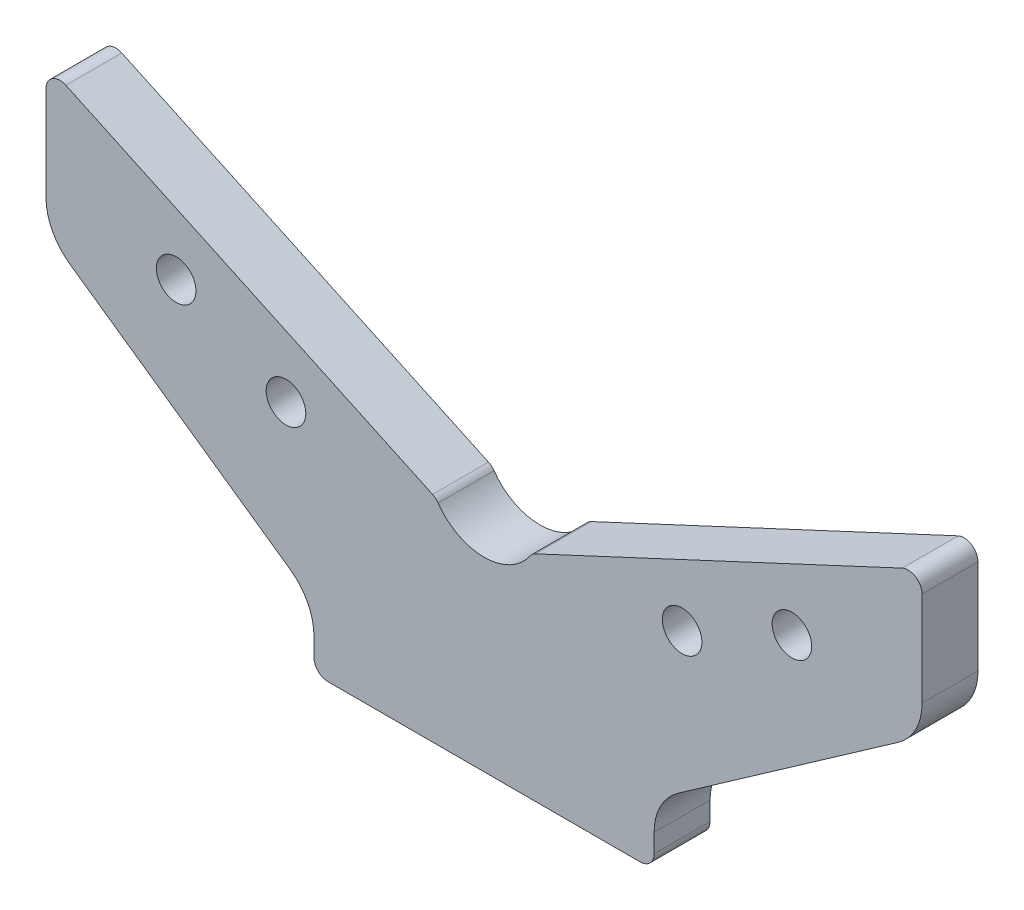
ISO-10303-21;
HEADER;
FILE_DESCRIPTION(('STEP AP214'),'2;1');
FILE_NAME('part.step','',(''),(''),'','','');
FILE_SCHEMA(('AUTOMOTIVE_DESIGN { 1 0 10303 214 1 1 1 1 }'));
ENDSEC;
DATA;
#1=APPLICATION_CONTEXT('core data for automotive mechanical design processes');
#2=APPLICATION_PROTOCOL_DEFINITION('international standard','automotive_design',2000,#1);
#3=PRODUCT_CONTEXT('',#1,'mechanical');
#4=PRODUCT('Part','Part','',(#3));
#5=PRODUCT_RELATED_PRODUCT_CATEGORY('part','',(#4));
#6=PRODUCT_DEFINITION_FORMATION('','',#4);
#7=PRODUCT_DEFINITION_CONTEXT('part definition',#1,'design');
#8=PRODUCT_DEFINITION('design','',#6,#7);
#9=PRODUCT_DEFINITION_SHAPE('','',#8);
#10=(LENGTH_UNIT() NAMED_UNIT(*) SI_UNIT(.MILLI.,.METRE.));
#11=(NAMED_UNIT(*) PLANE_ANGLE_UNIT() SI_UNIT($,.RADIAN.));
#12=(NAMED_UNIT(*) SI_UNIT($,.STERADIAN.) SOLID_ANGLE_UNIT());
#13=UNCERTAINTY_MEASURE_WITH_UNIT(LENGTH_MEASURE(1.E-05),#10,'distance_accuracy_value','');
#14=(GEOMETRIC_REPRESENTATION_CONTEXT(3) GLOBAL_UNCERTAINTY_ASSIGNED_CONTEXT((#13)) GLOBAL_UNIT_ASSIGNED_CONTEXT((#10,
#11,#12)) REPRESENTATION_CONTEXT('',''));
#15=CARTESIAN_POINT('',(0.,0.,0.));
#16=DIRECTION('',(0.,0.,1.));
#17=DIRECTION('',(1.,0.,0.));
#18=AXIS2_PLACEMENT_3D('',#15,#16,#17);
#19=CARTESIAN_POINT('',(0.,0.,12.));
#20=DIRECTION('',(0.,1.,0.));
#21=DIRECTION('',(-1.,0.,0.));
#22=AXIS2_PLACEMENT_3D('',#19,#20,#21);
#23=PLANE('',#22);
#24=DIRECTION('',(1.,0.,0.));
#25=VECTOR('',#24,1.);
#26=CARTESIAN_POINT('',(0.,0.,0.));
#27=LINE('',#26,#25);
#28=CARTESIAN_POINT('',(-33.5,0.,0.));
#29=VERTEX_POINT('',#28);
#30=CARTESIAN_POINT('',(33.5,0.,0.));
#31=VERTEX_POINT('',#30);
#32=EDGE_CURVE('E135',#29,#31,#27,.T.);
#33=ORIENTED_EDGE('',*,*,#32,.T.);
#34=DIRECTION('',(0.,0.,-1.));
#35=VECTOR('',#34,1.);
#36=CARTESIAN_POINT('',(33.5,0.,12.));
#37=LINE('',#36,#35);
#38=CARTESIAN_POINT('',(33.5,0.,12.));
#39=VERTEX_POINT('',#38);
#40=EDGE_CURVE('E11',#39,#31,#37,.T.);
#41=ORIENTED_EDGE('',*,*,#40,.F.);
#42=DIRECTION('',(1.,0.,0.));
#43=VECTOR('',#42,1.);
#44=CARTESIAN_POINT('',(0.,0.,12.));
#45=LINE('',#44,#43);
#46=CARTESIAN_POINT('',(-33.5,0.,12.));
#47=VERTEX_POINT('',#46);
#48=EDGE_CURVE('E141',#47,#39,#45,.T.);
#49=ORIENTED_EDGE('',*,*,#48,.F.);
#50=DIRECTION('',(0.,0.,-1.));
#51=VECTOR('',#50,1.);
#52=CARTESIAN_POINT('',(-33.5,0.,12.));
#53=LINE('',#52,#51);
#54=EDGE_CURVE('E211',#47,#29,#53,.T.);
#55=ORIENTED_EDGE('',*,*,#54,.T.);
#56=EDGE_LOOP('',(#33,#41,#49,#55));
#57=FACE_BOUND('',#56,.T.);
#58=ADVANCED_FACE('F45',(#57),#23,.F.);
#59=CARTESIAN_POINT('',(33.5,3.,12.));
#60=DIRECTION('',(0.,0.,-1.));
#61=DIRECTION('',(-1.,0.,0.));
#62=AXIS2_PLACEMENT_3D('',#59,#60,#61);
#63=CYLINDRICAL_SURFACE('',#62,3.);
#64=CARTESIAN_POINT('',(33.5,3.,0.));
#65=DIRECTION('',(0.,0.,1.));
#66=DIRECTION('',(-1.,0.,0.));
#67=AXIS2_PLACEMENT_3D('',#64,#65,#66);
#68=CIRCLE('',#67,3.);
#69=CARTESIAN_POINT('',(36.5,3.00000000000002,0.));
#70=VERTEX_POINT('',#69);
#71=EDGE_CURVE('E216',#31,#70,#68,.T.);
#72=ORIENTED_EDGE('',*,*,#71,.T.);
#73=DIRECTION('',(0.,0.,-1.));
#74=VECTOR('',#73,1.);
#75=CARTESIAN_POINT('',(36.5,3.00000000000002,12.));
#76=LINE('',#75,#74);
#77=CARTESIAN_POINT('',(36.5,3.00000000000002,12.));
#78=VERTEX_POINT('',#77);
#79=EDGE_CURVE('E54',#78,#70,#76,.T.);
#80=ORIENTED_EDGE('',*,*,#79,.F.);
#81=CARTESIAN_POINT('',(33.5,3.,12.));
#82=DIRECTION('',(0.,0.,1.));
#83=DIRECTION('',(-1.,0.,0.));
#84=AXIS2_PLACEMENT_3D('',#81,#82,#83);
#85=CIRCLE('',#84,3.);
#86=EDGE_CURVE('E325',#39,#78,#85,.T.);
#87=ORIENTED_EDGE('',*,*,#86,.F.);
#88=ORIENTED_EDGE('',*,*,#40,.T.);
#89=EDGE_LOOP('',(#72,#80,#87,#88));
#90=FACE_BOUND('',#89,.T.);
#91=ADVANCED_FACE('F371',(#90),#63,.T.);
#92=CARTESIAN_POINT('',(36.5,6.99126194632092,12.));
#93=DIRECTION('',(-1.,0.,0.));
#94=DIRECTION('',(0.,-1.,0.));
#95=AXIS2_PLACEMENT_3D('',#92,#93,#94);
#96=PLANE('',#95);
#97=DIRECTION('',(0.,1.,0.));
#98=VECTOR('',#97,1.);
#99=CARTESIAN_POINT('',(36.5,6.99126194632092,0.));
#100=LINE('',#99,#98);
#101=CARTESIAN_POINT('',(36.5,6.99126194632092,0.));
#102=VERTEX_POINT('',#101);
#103=EDGE_CURVE('E219',#70,#102,#100,.T.);
#104=ORIENTED_EDGE('',*,*,#103,.T.);
#105=DIRECTION('',(0.,0.,-1.));
#106=VECTOR('',#105,1.);
#107=CARTESIAN_POINT('',(36.5,6.99126194632092,12.));
#108=LINE('',#107,#106);
#109=CARTESIAN_POINT('',(36.5,6.99126194632092,12.));
#110=VERTEX_POINT('',#109);
#111=EDGE_CURVE('E296',#110,#102,#108,.T.);
#112=ORIENTED_EDGE('',*,*,#111,.F.);
#113=DIRECTION('',(0.,1.,0.));
#114=VECTOR('',#113,1.);
#115=CARTESIAN_POINT('',(36.5,6.99126194632092,12.));
#116=LINE('',#115,#114);
#117=EDGE_CURVE('E327',#78,#110,#116,.T.);
#118=ORIENTED_EDGE('',*,*,#117,.F.);
#119=ORIENTED_EDGE('',*,*,#79,.T.);
#120=EDGE_LOOP('',(#104,#112,#118,#119));
#121=FACE_BOUND('',#120,.T.);
#122=ADVANCED_FACE('F377',(#121),#96,.F.);
#123=CARTESIAN_POINT('',(48.5,6.99126194632092,12.));
#124=DIRECTION('',(0.,0.,-1.));
#125=DIRECTION('',(-1.,0.,0.));
#126=AXIS2_PLACEMENT_3D('',#123,#124,#125);
#127=CYLINDRICAL_SURFACE('',#126,12.);
#128=CARTESIAN_POINT('',(48.5,6.99126194632092,0.));
#129=DIRECTION('',(0.,0.,-1.));
#130=DIRECTION('',(-1.,0.,0.));
#131=AXIS2_PLACEMENT_3D('',#128,#129,#130);
#132=CIRCLE('',#131,12.);
#133=CARTESIAN_POINT('',(41.6170827637875,16.8210864777888,0.));
#134=VERTEX_POINT('',#133);
#135=EDGE_CURVE('E221',#102,#134,#132,.T.);
#136=ORIENTED_EDGE('',*,*,#135,.T.);
#137=DIRECTION('',(0.,0.,-1.));
#138=VECTOR('',#137,1.);
#139=CARTESIAN_POINT('',(41.6170827637875,16.8210864777888,12.));
#140=LINE('',#139,#138);
#141=CARTESIAN_POINT('',(41.6170827637875,16.8210864777888,12.));
#142=VERTEX_POINT('',#141);
#143=EDGE_CURVE('E293',#142,#134,#140,.T.);
#144=ORIENTED_EDGE('',*,*,#143,.F.);
#145=CARTESIAN_POINT('',(48.5,6.99126194632092,12.));
#146=DIRECTION('',(0.,0.,-1.));
#147=DIRECTION('',(-1.,0.,0.));
#148=AXIS2_PLACEMENT_3D('',#145,#146,#147);
#149=CIRCLE('',#148,12.);
#150=EDGE_CURVE('E329',#110,#142,#149,.T.);
#151=ORIENTED_EDGE('',*,*,#150,.F.);
#152=ORIENTED_EDGE('',*,*,#111,.T.);
#153=EDGE_LOOP('',(#136,#144,#151,#152));
#154=FACE_BOUND('',#153,.T.);
#155=ADVANCED_FACE('F381',(#154),#127,.F.);
#156=CARTESIAN_POINT('',(41.6170827637875,16.8210864777888,12.));
#157=DIRECTION('',(-0.573576436351044,0.819152044288993,0.));
#158=DIRECTION('',(-0.819152044288993,-0.573576436351044,0.));
#159=AXIS2_PLACEMENT_3D('',#156,#157,#158);
#160=PLANE('',#159);
#161=DIRECTION('',(0.819152044288993,0.573576436351044,0.));
#162=VECTOR('',#161,1.);
#163=CARTESIAN_POINT('',(41.6170827637875,16.8210864777888,0.));
#164=LINE('',#163,#162);
#165=CARTESIAN_POINT('',(88.8829172362125,49.9169800751531,0.));
#166=VERTEX_POINT('',#165);
#167=EDGE_CURVE('E223',#134,#166,#164,.T.);
#168=ORIENTED_EDGE('',*,*,#167,.T.);
#169=DIRECTION('',(0.,0.,-1.));
#170=VECTOR('',#169,1.);
#171=CARTESIAN_POINT('',(88.8829172362125,49.9169800751531,12.));
#172=LINE('',#171,#170);
#173=CARTESIAN_POINT('',(88.8829172362125,49.9169800751531,12.));
#174=VERTEX_POINT('',#173);
#175=EDGE_CURVE('E290',#174,#166,#172,.T.);
#176=ORIENTED_EDGE('',*,*,#175,.F.);
#177=DIRECTION('',(0.819152044288993,0.573576436351044,0.));
#178=VECTOR('',#177,1.);
#179=CARTESIAN_POINT('',(41.6170827637875,16.8210864777888,12.));
#180=LINE('',#179,#178);
#181=EDGE_CURVE('E331',#142,#174,#180,.T.);
#182=ORIENTED_EDGE('',*,*,#181,.F.);
#183=ORIENTED_EDGE('',*,*,#143,.T.);
#184=EDGE_LOOP('',(#168,#176,#182,#183));
#185=FACE_BOUND('',#184,.T.);
#186=ADVANCED_FACE('F386',(#185),#160,.F.);
#187=CARTESIAN_POINT('',(82.,59.746804606621,12.));
#188=DIRECTION('',(0.,0.,-1.));
#189=DIRECTION('',(-1.,0.,0.));
#190=AXIS2_PLACEMENT_3D('',#187,#188,#189);
#191=CYLINDRICAL_SURFACE('',#190,12.);
#192=CARTESIAN_POINT('',(82.,59.746804606621,0.));
#193=DIRECTION('',(0.,0.,1.));
#194=DIRECTION('',(1.,0.,0.));
#195=AXIS2_PLACEMENT_3D('',#192,#193,#194);
#196=CIRCLE('',#195,12.);
#197=CARTESIAN_POINT('',(94.,59.746804606621,0.));
#198=VERTEX_POINT('',#197);
#199=EDGE_CURVE('E225',#166,#198,#196,.T.);
#200=ORIENTED_EDGE('',*,*,#199,.T.);
#201=DIRECTION('',(0.,0.,-1.));
#202=VECTOR('',#201,1.);
#203=CARTESIAN_POINT('',(94.,59.746804606621,12.));
#204=LINE('',#203,#202);
#205=CARTESIAN_POINT('',(94.,59.746804606621,12.));
#206=VERTEX_POINT('',#205);
#207=EDGE_CURVE('E287',#206,#198,#204,.T.);
#208=ORIENTED_EDGE('',*,*,#207,.F.);
#209=CARTESIAN_POINT('',(82.,59.746804606621,12.));
#210=DIRECTION('',(0.,0.,1.));
#211=DIRECTION('',(1.,0.,0.));
#212=AXIS2_PLACEMENT_3D('',#209,#210,#211);
#213=CIRCLE('',#212,12.);
#214=EDGE_CURVE('E333',#174,#206,#213,.T.);
#215=ORIENTED_EDGE('',*,*,#214,.F.);
#216=ORIENTED_EDGE('',*,*,#175,.T.);
#217=EDGE_LOOP('',(#200,#208,#215,#216));
#218=FACE_BOUND('',#217,.T.);
#219=ADVANCED_FACE('F392',(#218),#191,.T.);
#220=CARTESIAN_POINT('',(94.,59.746804606621,12.));
#221=DIRECTION('',(-1.,0.,0.));
#222=DIRECTION('',(0.,0.,1.));
#223=AXIS2_PLACEMENT_3D('',#220,#221,#222);
#224=PLANE('',#223);
#225=DIRECTION('',(0.,1.,0.));
#226=VECTOR('',#225,1.);
#227=CARTESIAN_POINT('',(94.,59.746804606621,0.));
#228=LINE('',#227,#226);
#229=CARTESIAN_POINT('',(94.,80.,0.));
#230=VERTEX_POINT('',#229);
#231=EDGE_CURVE('E227',#198,#230,#228,.T.);
#232=ORIENTED_EDGE('',*,*,#231,.T.);
#233=DIRECTION('',(0.,0.,-1.));
#234=VECTOR('',#233,1.);
#235=CARTESIAN_POINT('',(94.,80.,12.));
#236=LINE('',#235,#234);
#237=CARTESIAN_POINT('',(94.,80.,12.));
#238=VERTEX_POINT('',#237);
#239=EDGE_CURVE('E284',#238,#230,#236,.T.);
#240=ORIENTED_EDGE('',*,*,#239,.F.);
#241=DIRECTION('',(0.,1.,0.));
#242=VECTOR('',#241,1.);
#243=CARTESIAN_POINT('',(94.,59.746804606621,12.));
#244=LINE('',#243,#242);
#245=EDGE_CURVE('E335',#206,#238,#244,.T.);
#246=ORIENTED_EDGE('',*,*,#245,.F.);
#247=ORIENTED_EDGE('',*,*,#207,.T.);
#248=EDGE_LOOP('',(#232,#240,#246,#247));
#249=FACE_BOUND('',#248,.T.);
#250=ADVANCED_FACE('F396',(#249),#224,.F.);
#251=CARTESIAN_POINT('',(91.,80.,12.));
#252=DIRECTION('',(0.,0.,-1.));
#253=DIRECTION('',(-1.,0.,0.));
#254=AXIS2_PLACEMENT_3D('',#251,#252,#253);
#255=CYLINDRICAL_SURFACE('',#254,2.99999999999999);
#256=CARTESIAN_POINT('',(91.,80.,0.));
#257=DIRECTION('',(0.,0.,1.));
#258=DIRECTION('',(-1.,0.,0.));
#259=AXIS2_PLACEMENT_3D('',#256,#257,#258);
#260=CIRCLE('',#259,2.99999999999999);
#261=CARTESIAN_POINT('',(89.7321452147779,82.7189233611099,0.));
#262=VERTEX_POINT('',#261);
#263=EDGE_CURVE('E229',#230,#262,#260,.T.);
#264=ORIENTED_EDGE('',*,*,#263,.T.);
#265=DIRECTION('',(0.,0.,-1.));
#266=VECTOR('',#265,1.);
#267=CARTESIAN_POINT('',(89.7321452147779,82.7189233611099,12.));
#268=LINE('',#267,#266);
#269=CARTESIAN_POINT('',(89.7321452147779,82.7189233611099,12.));
#270=VERTEX_POINT('',#269);
#271=EDGE_CURVE('E281',#270,#262,#268,.T.);
#272=ORIENTED_EDGE('',*,*,#271,.F.);
#273=CARTESIAN_POINT('',(91.,80.,12.));
#274=DIRECTION('',(0.,0.,1.));
#275=DIRECTION('',(-1.,0.,0.));
#276=AXIS2_PLACEMENT_3D('',#273,#274,#275);
#277=CIRCLE('',#276,2.99999999999999);
#278=EDGE_CURVE('E337',#238,#270,#277,.T.);
#279=ORIENTED_EDGE('',*,*,#278,.F.);
#280=ORIENTED_EDGE('',*,*,#239,.T.);
#281=EDGE_LOOP('',(#264,#272,#279,#280));
#282=FACE_BOUND('',#281,.T.);
#283=ADVANCED_FACE('F401',(#282),#255,.T.);
#284=CARTESIAN_POINT('',(89.7321452147779,82.7189233611099,12.));
#285=DIRECTION('',(0.422618261740705,-0.906307787036647,0.));
#286=DIRECTION('',(0.906307787036647,0.422618261740705,0.));
#287=AXIS2_PLACEMENT_3D('',#284,#285,#286);
#288=PLANE('',#287);
#289=DIRECTION('',(-0.906307787036647,-0.422618261740705,0.));
#290=VECTOR('',#289,1.);
#291=CARTESIAN_POINT('',(89.7321452147779,82.7189233611099,0.));
#292=LINE('',#291,#290);
#293=CARTESIAN_POINT('',(11.0434047899439,46.0257610904384,0.));
#294=VERTEX_POINT('',#293);
#295=EDGE_CURVE('E231',#262,#294,#292,.T.);
#296=ORIENTED_EDGE('',*,*,#295,.T.);
#297=DIRECTION('',(0.,0.,-1.));
#298=VECTOR('',#297,1.);
#299=CARTESIAN_POINT('',(11.0434047899439,46.0257610904384,12.));
#300=LINE('',#299,#298);
#301=CARTESIAN_POINT('',(11.0434047899439,46.0257610904384,12.));
#302=VERTEX_POINT('',#301);
#303=EDGE_CURVE('E278',#302,#294,#300,.T.);
#304=ORIENTED_EDGE('',*,*,#303,.F.);
#305=DIRECTION('',(-0.906307787036647,-0.422618261740705,0.));
#306=VECTOR('',#305,1.);
#307=CARTESIAN_POINT('',(89.7321452147779,82.7189233611099,12.));
#308=LINE('',#307,#306);
#309=EDGE_CURVE('E339',#270,#302,#308,.T.);
#310=ORIENTED_EDGE('',*,*,#309,.F.);
#311=ORIENTED_EDGE('',*,*,#271,.T.);
#312=EDGE_LOOP('',(#296,#304,#310,#311));
#313=FACE_BOUND('',#312,.T.);
#314=ADVANCED_FACE('F407',(#313),#288,.F.);
#315=CARTESIAN_POINT('',(12.311259575166,43.3068377293284,12.));
#316=DIRECTION('',(0.,0.,-1.));
#317=DIRECTION('',(-1.,0.,0.));
#318=AXIS2_PLACEMENT_3D('',#315,#316,#317);
#319=CYLINDRICAL_SURFACE('',#318,3.00000000000002);
#320=CARTESIAN_POINT('',(12.311259575166,43.3068377293284,0.));
#321=DIRECTION('',(0.,0.,1.));
#322=DIRECTION('',(-1.,0.,0.));
#323=AXIS2_PLACEMENT_3D('',#320,#321,#322);
#324=CIRCLE('',#323,3.00000000000002);
#325=CARTESIAN_POINT('',(9.84900766013281,45.0206975564191,0.));
#326=VERTEX_POINT('',#325);
#327=EDGE_CURVE('E233',#294,#326,#324,.T.);
#328=ORIENTED_EDGE('',*,*,#327,.T.);
#329=DIRECTION('',(0.,0.,-1.));
#330=VECTOR('',#329,1.);
#331=CARTESIAN_POINT('',(9.84900766013281,45.0206975564191,12.));
#332=LINE('',#331,#330);
#333=CARTESIAN_POINT('',(9.84900766013281,45.0206975564191,12.));
#334=VERTEX_POINT('',#333);
#335=EDGE_CURVE('E275',#334,#326,#332,.T.);
#336=ORIENTED_EDGE('',*,*,#335,.F.);
#337=CARTESIAN_POINT('',(12.311259575166,43.3068377293284,12.));
#338=DIRECTION('',(0.,0.,1.));
#339=DIRECTION('',(-1.,0.,0.));
#340=AXIS2_PLACEMENT_3D('',#337,#338,#339);
#341=CIRCLE('',#340,3.00000000000002);
#342=EDGE_CURVE('E341',#302,#334,#341,.T.);
#343=ORIENTED_EDGE('',*,*,#342,.F.);
#344=ORIENTED_EDGE('',*,*,#303,.T.);
#345=EDGE_LOOP('',(#328,#336,#343,#344));
#346=FACE_BOUND('',#345,.T.);
#347=ADVANCED_FACE('F411',(#346),#319,.T.);
#348=CARTESIAN_POINT('',(0.,51.8761368647818,12.));
#349=DIRECTION('',(0.,0.,-1.));
#350=DIRECTION('',(-1.,0.,0.));
#351=AXIS2_PLACEMENT_3D('',#348,#349,#350);
#352=CYLINDRICAL_SURFACE('',#351,12.);
#353=CARTESIAN_POINT('',(0.,51.8761368647818,0.));
#354=DIRECTION('',(0.,0.,-1.));
#355=DIRECTION('',(1.,0.,0.));
#356=AXIS2_PLACEMENT_3D('',#353,#354,#355);
#357=CIRCLE('',#356,12.);
#358=CARTESIAN_POINT('',(-9.84900766013283,45.0206975564191,0.));
#359=VERTEX_POINT('',#358);
#360=EDGE_CURVE('E235',#326,#359,#357,.T.);
#361=ORIENTED_EDGE('',*,*,#360,.T.);
#362=DIRECTION('',(0.,0.,-1.));
#363=VECTOR('',#362,1.);
#364=CARTESIAN_POINT('',(-9.84900766013283,45.0206975564191,12.));
#365=LINE('',#364,#363);
#366=CARTESIAN_POINT('',(-9.84900766013283,45.0206975564191,12.));
#367=VERTEX_POINT('',#366);
#368=EDGE_CURVE('E272',#367,#359,#365,.T.);
#369=ORIENTED_EDGE('',*,*,#368,.F.);
#370=CARTESIAN_POINT('',(0.,51.8761368647818,12.));
#371=DIRECTION('',(0.,0.,-1.));
#372=DIRECTION('',(1.,0.,0.));
#373=AXIS2_PLACEMENT_3D('',#370,#371,#372);
#374=CIRCLE('',#373,12.);
#375=EDGE_CURVE('E343',#334,#367,#374,.T.);
#376=ORIENTED_EDGE('',*,*,#375,.F.);
#377=ORIENTED_EDGE('',*,*,#335,.T.);
#378=EDGE_LOOP('',(#361,#369,#376,#377));
#379=FACE_BOUND('',#378,.T.);
#380=ADVANCED_FACE('F416',(#379),#352,.F.);
#381=CARTESIAN_POINT('',(-12.311259575166,43.3068377293284,12.));
#382=DIRECTION('',(0.,0.,-1.));
#383=DIRECTION('',(-1.,0.,0.));
#384=AXIS2_PLACEMENT_3D('',#381,#382,#383);
#385=CYLINDRICAL_SURFACE('',#384,3.00000000000002);
#386=CARTESIAN_POINT('',(-12.311259575166,43.3068377293284,0.));
#387=DIRECTION('',(0.,0.,1.));
#388=DIRECTION('',(1.,0.,0.));
#389=AXIS2_PLACEMENT_3D('',#386,#387,#388);
#390=CIRCLE('',#389,3.00000000000002);
#391=CARTESIAN_POINT('',(-11.0434047899439,46.0257610904384,0.));
#392=VERTEX_POINT('',#391);
#393=EDGE_CURVE('E237',#359,#392,#390,.T.);
#394=ORIENTED_EDGE('',*,*,#393,.T.);
#395=DIRECTION('',(0.,0.,-1.));
#396=VECTOR('',#395,1.);
#397=CARTESIAN_POINT('',(-11.0434047899439,46.0257610904384,12.));
#398=LINE('',#397,#396);
#399=CARTESIAN_POINT('',(-11.0434047899439,46.0257610904384,12.));
#400=VERTEX_POINT('',#399);
#401=EDGE_CURVE('E269',#400,#392,#398,.T.);
#402=ORIENTED_EDGE('',*,*,#401,.F.);
#403=CARTESIAN_POINT('',(-12.311259575166,43.3068377293284,12.));
#404=DIRECTION('',(0.,0.,1.));
#405=DIRECTION('',(1.,0.,0.));
#406=AXIS2_PLACEMENT_3D('',#403,#404,#405);
#407=CIRCLE('',#406,3.00000000000002);
#408=EDGE_CURVE('E345',#367,#400,#407,.T.);
#409=ORIENTED_EDGE('',*,*,#408,.F.);
#410=ORIENTED_EDGE('',*,*,#368,.T.);
#411=EDGE_LOOP('',(#394,#402,#409,#410));
#412=FACE_BOUND('',#411,.T.);
#413=ADVANCED_FACE('F422',(#412),#385,.T.);
#414=CARTESIAN_POINT('',(-89.7321452147779,82.7189233611099,12.));
#415=DIRECTION('',(-0.422618261740705,-0.906307787036647,0.));
#416=DIRECTION('',(0.906307787036647,-0.422618261740705,0.));
#417=AXIS2_PLACEMENT_3D('',#414,#415,#416);
#418=PLANE('',#417);
#419=DIRECTION('',(-0.906307787036647,0.422618261740705,0.));
#420=VECTOR('',#419,1.);
#421=CARTESIAN_POINT('',(-89.7321452147779,82.7189233611099,0.));
#422=LINE('',#421,#420);
#423=CARTESIAN_POINT('',(-89.7321452147779,82.7189233611099,0.));
#424=VERTEX_POINT('',#423);
#425=EDGE_CURVE('E239',#392,#424,#422,.T.);
#426=ORIENTED_EDGE('',*,*,#425,.T.);
#427=DIRECTION('',(0.,0.,-1.));
#428=VECTOR('',#427,1.);
#429=CARTESIAN_POINT('',(-89.7321452147779,82.7189233611099,12.));
#430=LINE('',#429,#428);
#431=CARTESIAN_POINT('',(-89.7321452147779,82.7189233611099,12.));
#432=VERTEX_POINT('',#431);
#433=EDGE_CURVE('E266',#432,#424,#430,.T.);
#434=ORIENTED_EDGE('',*,*,#433,.F.);
#435=DIRECTION('',(-0.906307787036647,0.422618261740705,0.));
#436=VECTOR('',#435,1.);
#437=CARTESIAN_POINT('',(-89.7321452147779,82.7189233611099,12.));
#438=LINE('',#437,#436);
#439=EDGE_CURVE('E347',#400,#432,#438,.T.);
#440=ORIENTED_EDGE('',*,*,#439,.F.);
#441=ORIENTED_EDGE('',*,*,#401,.T.);
#442=EDGE_LOOP('',(#426,#434,#440,#441));
#443=FACE_BOUND('',#442,.T.);
#444=ADVANCED_FACE('F426',(#443),#418,.F.);
#445=CARTESIAN_POINT('',(-91.,80.,12.));
#446=DIRECTION('',(0.,0.,-1.));
#447=DIRECTION('',(-1.,0.,0.));
#448=AXIS2_PLACEMENT_3D('',#445,#446,#447);
#449=CYLINDRICAL_SURFACE('',#448,2.99999999999999);
#450=CARTESIAN_POINT('',(-91.,80.,0.));
#451=DIRECTION('',(0.,0.,1.));
#452=DIRECTION('',(-1.,0.,0.));
#453=AXIS2_PLACEMENT_3D('',#450,#451,#452);
#454=CIRCLE('',#453,2.99999999999999);
#455=CARTESIAN_POINT('',(-94.,80.,0.));
#456=VERTEX_POINT('',#455);
#457=EDGE_CURVE('E241',#424,#456,#454,.T.);
#458=ORIENTED_EDGE('',*,*,#457,.T.);
#459=DIRECTION('',(0.,0.,-1.));
#460=VECTOR('',#459,1.);
#461=CARTESIAN_POINT('',(-94.,80.,12.));
#462=LINE('',#461,#460);
#463=CARTESIAN_POINT('',(-94.,80.,12.));
#464=VERTEX_POINT('',#463);
#465=EDGE_CURVE('E263',#464,#456,#462,.T.);
#466=ORIENTED_EDGE('',*,*,#465,.F.);
#467=CARTESIAN_POINT('',(-91.,80.,12.));
#468=DIRECTION('',(0.,0.,1.));
#469=DIRECTION('',(-1.,0.,0.));
#470=AXIS2_PLACEMENT_3D('',#467,#468,#469);
#471=CIRCLE('',#470,2.99999999999999);
#472=EDGE_CURVE('E349',#432,#464,#471,.T.);
#473=ORIENTED_EDGE('',*,*,#472,.F.);
#474=ORIENTED_EDGE('',*,*,#433,.T.);
#475=EDGE_LOOP('',(#458,#466,#473,#474));
#476=FACE_BOUND('',#475,.T.);
#477=ADVANCED_FACE('F431',(#476),#449,.T.);
#478=CARTESIAN_POINT('',(-94.,59.746804606621,12.));
#479=DIRECTION('',(1.,0.,0.));
#480=DIRECTION('',(0.,0.,-1.));
#481=AXIS2_PLACEMENT_3D('',#478,#479,#480);
#482=PLANE('',#481);
#483=DIRECTION('',(0.,-1.,0.));
#484=VECTOR('',#483,1.);
#485=CARTESIAN_POINT('',(-94.,59.746804606621,0.));
#486=LINE('',#485,#484);
#487=CARTESIAN_POINT('',(-94.,59.746804606621,0.));
#488=VERTEX_POINT('',#487);
#489=EDGE_CURVE('E243',#456,#488,#486,.T.);
#490=ORIENTED_EDGE('',*,*,#489,.T.);
#491=DIRECTION('',(0.,0.,-1.));
#492=VECTOR('',#491,1.);
#493=CARTESIAN_POINT('',(-94.,59.746804606621,12.));
#494=LINE('',#493,#492);
#495=CARTESIAN_POINT('',(-94.,59.746804606621,12.));
#496=VERTEX_POINT('',#495);
#497=EDGE_CURVE('E260',#496,#488,#494,.T.);
#498=ORIENTED_EDGE('',*,*,#497,.F.);
#499=DIRECTION('',(0.,-1.,0.));
#500=VECTOR('',#499,1.);
#501=CARTESIAN_POINT('',(-94.,59.746804606621,12.));
#502=LINE('',#501,#500);
#503=EDGE_CURVE('E351',#464,#496,#502,.T.);
#504=ORIENTED_EDGE('',*,*,#503,.F.);
#505=ORIENTED_EDGE('',*,*,#465,.T.);
#506=EDGE_LOOP('',(#490,#498,#504,#505));
#507=FACE_BOUND('',#506,.T.);
#508=ADVANCED_FACE('F434',(#507),#482,.F.);
#509=CARTESIAN_POINT('',(-82.,59.746804606621,12.));
#510=DIRECTION('',(0.,0.,-1.));
#511=DIRECTION('',(-1.,0.,0.));
#512=AXIS2_PLACEMENT_3D('',#509,#510,#511);
#513=CYLINDRICAL_SURFACE('',#512,12.);
#514=CARTESIAN_POINT('',(-82.,59.746804606621,0.));
#515=DIRECTION('',(0.,0.,1.));
#516=DIRECTION('',(-1.,0.,0.));
#517=AXIS2_PLACEMENT_3D('',#514,#515,#516);
#518=CIRCLE('',#517,12.);
#519=CARTESIAN_POINT('',(-88.8829172362125,49.9169800751531,0.));
#520=VERTEX_POINT('',#519);
#521=EDGE_CURVE('E245',#488,#520,#518,.T.);
#522=ORIENTED_EDGE('',*,*,#521,.T.);
#523=DIRECTION('',(0.,0.,-1.));
#524=VECTOR('',#523,1.);
#525=CARTESIAN_POINT('',(-88.8829172362125,49.9169800751531,12.));
#526=LINE('',#525,#524);
#527=CARTESIAN_POINT('',(-88.8829172362125,49.9169800751531,12.));
#528=VERTEX_POINT('',#527);
#529=EDGE_CURVE('E257',#528,#520,#526,.T.);
#530=ORIENTED_EDGE('',*,*,#529,.F.);
#531=CARTESIAN_POINT('',(-82.,59.746804606621,12.));
#532=DIRECTION('',(0.,0.,1.));
#533=DIRECTION('',(-1.,0.,0.));
#534=AXIS2_PLACEMENT_3D('',#531,#532,#533);
#535=CIRCLE('',#534,12.);
#536=EDGE_CURVE('E353',#496,#528,#535,.T.);
#537=ORIENTED_EDGE('',*,*,#536,.F.);
#538=ORIENTED_EDGE('',*,*,#497,.T.);
#539=EDGE_LOOP('',(#522,#530,#537,#538));
#540=FACE_BOUND('',#539,.T.);
#541=ADVANCED_FACE('F359',(#540),#513,.T.);
#542=CARTESIAN_POINT('',(-41.6170827637875,16.8210864777888,12.));
#543=DIRECTION('',(0.573576436351044,0.819152044288993,0.));
#544=DIRECTION('',(-0.819152044288993,0.573576436351044,0.));
#545=AXIS2_PLACEMENT_3D('',#542,#543,#544);
#546=PLANE('',#545);
#547=DIRECTION('',(0.819152044288993,-0.573576436351044,0.));
#548=VECTOR('',#547,1.);
#549=CARTESIAN_POINT('',(-41.6170827637875,16.8210864777888,0.));
#550=LINE('',#549,#548);
#551=CARTESIAN_POINT('',(-41.6170827637875,16.8210864777888,0.));
#552=VERTEX_POINT('',#551);
#553=EDGE_CURVE('E247',#520,#552,#550,.T.);
#554=ORIENTED_EDGE('',*,*,#553,.T.);
#555=DIRECTION('',(0.,0.,-1.));
#556=VECTOR('',#555,1.);
#557=CARTESIAN_POINT('',(-41.6170827637875,16.8210864777888,12.));
#558=LINE('',#557,#556);
#559=CARTESIAN_POINT('',(-41.6170827637875,16.8210864777888,12.));
#560=VERTEX_POINT('',#559);
#561=EDGE_CURVE('E206',#560,#552,#558,.T.);
#562=ORIENTED_EDGE('',*,*,#561,.F.);
#563=DIRECTION('',(0.819152044288993,-0.573576436351044,0.));
#564=VECTOR('',#563,1.);
#565=CARTESIAN_POINT('',(-41.6170827637875,16.8210864777888,12.));
#566=LINE('',#565,#564);
#567=EDGE_CURVE('E197',#528,#560,#566,.T.);
#568=ORIENTED_EDGE('',*,*,#567,.F.);
#569=ORIENTED_EDGE('',*,*,#529,.T.);
#570=EDGE_LOOP('',(#554,#562,#568,#569));
#571=FACE_BOUND('',#570,.T.);
#572=ADVANCED_FACE('F363',(#571),#546,.F.);
#573=CARTESIAN_POINT('',(-48.5,6.99126194632092,12.));
#574=DIRECTION('',(0.,0.,-1.));
#575=DIRECTION('',(-1.,0.,0.));
#576=AXIS2_PLACEMENT_3D('',#573,#574,#575);
#577=CYLINDRICAL_SURFACE('',#576,12.);
#578=CARTESIAN_POINT('',(-48.5,6.99126194632092,0.));
#579=DIRECTION('',(0.,0.,-1.));
#580=DIRECTION('',(1.,0.,0.));
#581=AXIS2_PLACEMENT_3D('',#578,#579,#580);
#582=CIRCLE('',#581,12.);
#583=CARTESIAN_POINT('',(-36.5,6.99126194632092,0.));
#584=VERTEX_POINT('',#583);
#585=EDGE_CURVE('E205',#552,#584,#582,.T.);
#586=ORIENTED_EDGE('',*,*,#585,.T.);
#587=DIRECTION('',(0.,0.,-1.));
#588=VECTOR('',#587,1.);
#589=CARTESIAN_POINT('',(-36.5,6.99126194632092,12.));
#590=LINE('',#589,#588);
#591=CARTESIAN_POINT('',(-36.5,6.99126194632092,12.));
#592=VERTEX_POINT('',#591);
#593=EDGE_CURVE('E202',#592,#584,#590,.T.);
#594=ORIENTED_EDGE('',*,*,#593,.F.);
#595=CARTESIAN_POINT('',(-48.5,6.99126194632092,12.));
#596=DIRECTION('',(0.,0.,-1.));
#597=DIRECTION('',(1.,0.,0.));
#598=AXIS2_PLACEMENT_3D('',#595,#596,#597);
#599=CIRCLE('',#598,12.);
#600=EDGE_CURVE('E191',#560,#592,#599,.T.);
#601=ORIENTED_EDGE('',*,*,#600,.F.);
#602=ORIENTED_EDGE('',*,*,#561,.T.);
#603=EDGE_LOOP('',(#586,#594,#601,#602));
#604=FACE_BOUND('',#603,.T.);
#605=ADVANCED_FACE('F203',(#604),#577,.F.);
#606=CARTESIAN_POINT('',(-36.5,6.99126194632092,12.));
#607=DIRECTION('',(1.,0.,0.));
#608=DIRECTION('',(0.,1.,0.));
#609=AXIS2_PLACEMENT_3D('',#606,#607,#608);
#610=PLANE('',#609);
#611=DIRECTION('',(0.,-1.,0.));
#612=VECTOR('',#611,1.);
#613=CARTESIAN_POINT('',(-36.5,6.99126194632092,0.));
#614=LINE('',#613,#612);
#615=CARTESIAN_POINT('',(-36.5,3.00000000000002,0.));
#616=VERTEX_POINT('',#615);
#617=EDGE_CURVE('E128',#584,#616,#614,.T.);
#618=ORIENTED_EDGE('',*,*,#617,.T.);
#619=DIRECTION('',(0.,0.,-1.));
#620=VECTOR('',#619,1.);
#621=CARTESIAN_POINT('',(-36.5,3.00000000000002,12.));
#622=LINE('',#621,#620);
#623=CARTESIAN_POINT('',(-36.5,3.00000000000002,12.));
#624=VERTEX_POINT('',#623);
#625=EDGE_CURVE('E207',#624,#616,#622,.T.);
#626=ORIENTED_EDGE('',*,*,#625,.F.);
#627=DIRECTION('',(0.,-1.,0.));
#628=VECTOR('',#627,1.);
#629=CARTESIAN_POINT('',(-36.5,6.99126194632092,12.));
#630=LINE('',#629,#628);
#631=EDGE_CURVE('E195',#592,#624,#630,.T.);
#632=ORIENTED_EDGE('',*,*,#631,.F.);
#633=ORIENTED_EDGE('',*,*,#593,.T.);
#634=EDGE_LOOP('',(#618,#626,#632,#633));
#635=FACE_BOUND('',#634,.T.);
#636=ADVANCED_FACE('F209',(#635),#610,.F.);
#637=CARTESIAN_POINT('',(-33.5,3.,12.));
#638=DIRECTION('',(0.,0.,-1.));
#639=DIRECTION('',(-1.,0.,0.));
#640=AXIS2_PLACEMENT_3D('',#637,#638,#639);
#641=CYLINDRICAL_SURFACE('',#640,3.);
#642=CARTESIAN_POINT('',(-33.5,3.,0.));
#643=DIRECTION('',(0.,0.,1.));
#644=DIRECTION('',(1.,0.,0.));
#645=AXIS2_PLACEMENT_3D('',#642,#643,#644);
#646=CIRCLE('',#645,3.);
#647=EDGE_CURVE('E251',#616,#29,#646,.T.);
#648=ORIENTED_EDGE('',*,*,#647,.T.);
#649=ORIENTED_EDGE('',*,*,#54,.F.);
#650=CARTESIAN_POINT('',(-33.5,3.,12.));
#651=DIRECTION('',(0.,0.,1.));
#652=DIRECTION('',(1.,0.,0.));
#653=AXIS2_PLACEMENT_3D('',#650,#651,#652);
#654=CIRCLE('',#653,3.);
#655=EDGE_CURVE('E63',#624,#47,#654,.T.);
#656=ORIENTED_EDGE('',*,*,#655,.F.);
#657=ORIENTED_EDGE('',*,*,#625,.T.);
#658=EDGE_LOOP('',(#648,#649,#656,#657));
#659=FACE_BOUND('',#658,.T.);
#660=ADVANCED_FACE('F366',(#659),#641,.T.);
#661=CARTESIAN_POINT('',(-33.5,3.,12.));
#662=DIRECTION('',(0.,0.,1.));
#663=DIRECTION('',(1.,0.,0.));
#664=AXIS2_PLACEMENT_3D('',#661,#662,#663);
#665=PLANE('',#664);
#666=CARTESIAN_POINT('',(-66.0640024629528,58.441752114078,12.));
#667=DIRECTION('',(0.,0.,1.));
#668=DIRECTION('',(1.,0.,0.));
#669=AXIS2_PLACEMENT_3D('',#666,#667,#668);
#670=CIRCLE('',#669,4.25);
#671=CARTESIAN_POINT('',(-61.8140024629528,58.441752114078,12.));
#672=VERTEX_POINT('',#671);
#673=EDGE_CURVE('E319',#672,#672,#670,.T.);
#674=ORIENTED_EDGE('',*,*,#673,.F.);
#675=EDGE_LOOP('',(#674));
#676=FACE_BOUND('',#675,.T.);
#677=CARTESIAN_POINT('',(-42.5,47.4536773088197,12.));
#678=DIRECTION('',(0.,0.,1.));
#679=DIRECTION('',(1.,0.,0.));
#680=AXIS2_PLACEMENT_3D('',#677,#678,#679);
#681=CIRCLE('',#680,4.25);
#682=CARTESIAN_POINT('',(-38.25,47.4536773088197,12.));
#683=VERTEX_POINT('',#682);
#684=EDGE_CURVE('E309',#683,#683,#681,.T.);
#685=ORIENTED_EDGE('',*,*,#684,.F.);
#686=EDGE_LOOP('',(#685));
#687=FACE_BOUND('',#686,.T.);
#688=CARTESIAN_POINT('',(66.0640024629528,58.441752114078,12.));
#689=DIRECTION('',(0.,0.,1.));
#690=DIRECTION('',(1.,0.,0.));
#691=AXIS2_PLACEMENT_3D('',#688,#689,#690);
#692=CIRCLE('',#691,4.25);
#693=CARTESIAN_POINT('',(70.3140024629528,58.441752114078,12.));
#694=VERTEX_POINT('',#693);
#695=EDGE_CURVE('E306',#694,#694,#692,.T.);
#696=ORIENTED_EDGE('',*,*,#695,.F.);
#697=EDGE_LOOP('',(#696));
#698=FACE_BOUND('',#697,.T.);
#699=CARTESIAN_POINT('',(42.5,47.4536773088197,12.));
#700=DIRECTION('',(0.,0.,1.));
#701=DIRECTION('',(1.,0.,0.));
#702=AXIS2_PLACEMENT_3D('',#699,#700,#701);
#703=CIRCLE('',#702,4.25);
#704=CARTESIAN_POINT('',(46.75,47.4536773088197,12.));
#705=VERTEX_POINT('',#704);
#706=EDGE_CURVE('E303',#705,#705,#703,.T.);
#707=ORIENTED_EDGE('',*,*,#706,.F.);
#708=EDGE_LOOP('',(#707));
#709=FACE_BOUND('',#708,.T.);
#710=ORIENTED_EDGE('',*,*,#48,.T.);
#711=ORIENTED_EDGE('',*,*,#86,.T.);
#712=ORIENTED_EDGE('',*,*,#117,.T.);
#713=ORIENTED_EDGE('',*,*,#150,.T.);
#714=ORIENTED_EDGE('',*,*,#181,.T.);
#715=ORIENTED_EDGE('',*,*,#214,.T.);
#716=ORIENTED_EDGE('',*,*,#245,.T.);
#717=ORIENTED_EDGE('',*,*,#278,.T.);
#718=ORIENTED_EDGE('',*,*,#309,.T.);
#719=ORIENTED_EDGE('',*,*,#342,.T.);
#720=ORIENTED_EDGE('',*,*,#375,.T.);
#721=ORIENTED_EDGE('',*,*,#408,.T.);
#722=ORIENTED_EDGE('',*,*,#439,.T.);
#723=ORIENTED_EDGE('',*,*,#472,.T.);
#724=ORIENTED_EDGE('',*,*,#503,.T.);
#725=ORIENTED_EDGE('',*,*,#536,.T.);
#726=ORIENTED_EDGE('',*,*,#567,.T.);
#727=ORIENTED_EDGE('',*,*,#600,.T.);
#728=ORIENTED_EDGE('',*,*,#631,.T.);
#729=ORIENTED_EDGE('',*,*,#655,.T.);
#730=EDGE_LOOP('',(#710,#711,#712,#713,#714,#715,#716,#717,#718,#719,#720,#721,#722,#723,#724,
#725,#726,#727,#728,#729));
#731=FACE_BOUND('',#730,.T.);
#732=ADVANCED_FACE('F193',(#676,#687,#698,#709,#731),#665,.T.);
#733=CARTESIAN_POINT('',(-33.5,3.,0.));
#734=DIRECTION('',(0.,0.,1.));
#735=DIRECTION('',(1.,0.,0.));
#736=AXIS2_PLACEMENT_3D('',#733,#734,#735);
#737=PLANE('',#736);
#738=CARTESIAN_POINT('',(-66.0640024629528,58.441752114078,0.));
#739=DIRECTION('',(0.,0.,1.));
#740=DIRECTION('',(1.,0.,0.));
#741=AXIS2_PLACEMENT_3D('',#738,#739,#740);
#742=CIRCLE('',#741,4.25);
#743=CARTESIAN_POINT('',(-61.8140024629528,58.441752114078,0.));
#744=VERTEX_POINT('',#743);
#745=EDGE_CURVE('E48',#744,#744,#742,.T.);
#746=ORIENTED_EDGE('',*,*,#745,.T.);
#747=EDGE_LOOP('',(#746));
#748=FACE_BOUND('',#747,.T.);
#749=CARTESIAN_POINT('',(-42.5,47.4536773088197,0.));
#750=DIRECTION('',(0.,0.,1.));
#751=DIRECTION('',(1.,0.,0.));
#752=AXIS2_PLACEMENT_3D('',#749,#750,#751);
#753=CIRCLE('',#752,4.25);
#754=CARTESIAN_POINT('',(-38.25,47.4536773088197,0.));
#755=VERTEX_POINT('',#754);
#756=EDGE_CURVE('E307',#755,#755,#753,.T.);
#757=ORIENTED_EDGE('',*,*,#756,.T.);
#758=EDGE_LOOP('',(#757));
#759=FACE_BOUND('',#758,.T.);
#760=CARTESIAN_POINT('',(66.0640024629528,58.441752114078,0.));
#761=DIRECTION('',(0.,0.,1.));
#762=DIRECTION('',(1.,0.,0.));
#763=AXIS2_PLACEMENT_3D('',#760,#761,#762);
#764=CIRCLE('',#763,4.25);
#765=CARTESIAN_POINT('',(70.3140024629528,58.441752114078,0.));
#766=VERTEX_POINT('',#765);
#767=EDGE_CURVE('E304',#766,#766,#764,.T.);
#768=ORIENTED_EDGE('',*,*,#767,.T.);
#769=EDGE_LOOP('',(#768));
#770=FACE_BOUND('',#769,.T.);
#771=CARTESIAN_POINT('',(42.5,47.4536773088197,0.));
#772=DIRECTION('',(0.,0.,1.));
#773=DIRECTION('',(1.,0.,0.));
#774=AXIS2_PLACEMENT_3D('',#771,#772,#773);
#775=CIRCLE('',#774,4.25);
#776=CARTESIAN_POINT('',(46.75,47.4536773088197,0.));
#777=VERTEX_POINT('',#776);
#778=EDGE_CURVE('E217',#777,#777,#775,.T.);
#779=ORIENTED_EDGE('',*,*,#778,.T.);
#780=EDGE_LOOP('',(#779));
#781=FACE_BOUND('',#780,.T.);
#782=ORIENTED_EDGE('',*,*,#32,.F.);
#783=ORIENTED_EDGE('',*,*,#647,.F.);
#784=ORIENTED_EDGE('',*,*,#617,.F.);
#785=ORIENTED_EDGE('',*,*,#585,.F.);
#786=ORIENTED_EDGE('',*,*,#553,.F.);
#787=ORIENTED_EDGE('',*,*,#521,.F.);
#788=ORIENTED_EDGE('',*,*,#489,.F.);
#789=ORIENTED_EDGE('',*,*,#457,.F.);
#790=ORIENTED_EDGE('',*,*,#425,.F.);
#791=ORIENTED_EDGE('',*,*,#393,.F.);
#792=ORIENTED_EDGE('',*,*,#360,.F.);
#793=ORIENTED_EDGE('',*,*,#327,.F.);
#794=ORIENTED_EDGE('',*,*,#295,.F.);
#795=ORIENTED_EDGE('',*,*,#263,.F.);
#796=ORIENTED_EDGE('',*,*,#231,.F.);
#797=ORIENTED_EDGE('',*,*,#199,.F.);
#798=ORIENTED_EDGE('',*,*,#167,.F.);
#799=ORIENTED_EDGE('',*,*,#135,.F.);
#800=ORIENTED_EDGE('',*,*,#103,.F.);
#801=ORIENTED_EDGE('',*,*,#71,.F.);
#802=EDGE_LOOP('',(#782,#783,#784,#785,#786,#787,#788,#789,#790,#791,#792,#793,#794,#795,#796,
#797,#798,#799,#800,#801));
#803=FACE_BOUND('',#802,.T.);
#804=ADVANCED_FACE('F364',(#748,#759,#770,#781,#803),#737,.F.);
#805=CARTESIAN_POINT('',(42.5,47.4536773088197,12.));
#806=DIRECTION('',(0.,0.,1.));
#807=DIRECTION('',(1.,0.,0.));
#808=AXIS2_PLACEMENT_3D('',#805,#806,#807);
#809=CYLINDRICAL_SURFACE('',#808,4.25);
#810=ORIENTED_EDGE('',*,*,#706,.T.);
#811=EDGE_LOOP('',(#810));
#812=FACE_BOUND('',#811,.T.);
#813=ORIENTED_EDGE('',*,*,#778,.F.);
#814=EDGE_LOOP('',(#813));
#815=FACE_BOUND('',#814,.T.);
#816=ADVANCED_FACE('F523',(#812,#815),#809,.F.);
#817=CARTESIAN_POINT('',(66.0640024629528,58.441752114078,12.));
#818=DIRECTION('',(0.,0.,1.));
#819=DIRECTION('',(1.,0.,0.));
#820=AXIS2_PLACEMENT_3D('',#817,#818,#819);
#821=CYLINDRICAL_SURFACE('',#820,4.25);
#822=ORIENTED_EDGE('',*,*,#695,.T.);
#823=EDGE_LOOP('',(#822));
#824=FACE_BOUND('',#823,.T.);
#825=ORIENTED_EDGE('',*,*,#767,.F.);
#826=EDGE_LOOP('',(#825));
#827=FACE_BOUND('',#826,.T.);
#828=ADVANCED_FACE('F532',(#824,#827),#821,.F.);
#829=CARTESIAN_POINT('',(-42.5,47.4536773088197,12.));
#830=DIRECTION('',(0.,0.,1.));
#831=DIRECTION('',(1.,0.,0.));
#832=AXIS2_PLACEMENT_3D('',#829,#830,#831);
#833=CYLINDRICAL_SURFACE('',#832,4.25);
#834=ORIENTED_EDGE('',*,*,#684,.T.);
#835=EDGE_LOOP('',(#834));
#836=FACE_BOUND('',#835,.T.);
#837=ORIENTED_EDGE('',*,*,#756,.F.);
#838=EDGE_LOOP('',(#837));
#839=FACE_BOUND('',#838,.T.);
#840=ADVANCED_FACE('F542',(#836,#839),#833,.F.);
#841=CARTESIAN_POINT('',(-66.0640024629528,58.441752114078,12.));
#842=DIRECTION('',(0.,0.,1.));
#843=DIRECTION('',(1.,0.,0.));
#844=AXIS2_PLACEMENT_3D('',#841,#842,#843);
#845=CYLINDRICAL_SURFACE('',#844,4.25);
#846=ORIENTED_EDGE('',*,*,#673,.T.);
#847=EDGE_LOOP('',(#846));
#848=FACE_BOUND('',#847,.T.);
#849=ORIENTED_EDGE('',*,*,#745,.F.);
#850=EDGE_LOOP('',(#849));
#851=FACE_BOUND('',#850,.T.);
#852=ADVANCED_FACE('F552',(#848,#851),#845,.F.);
#853=CLOSED_SHELL('',(#58,#91,#122,#155,#186,#219,#250,#283,#314,#347,#380,#413,#444,#477,#508,
#541,#572,#605,#636,#660,#732,#804,#816,#828,#840,#852));
#854=MANIFOLD_SOLID_BREP('B2',#853);
#855=ADVANCED_BREP_SHAPE_REPRESENTATION('',(#18,#854),#14);
#856=SHAPE_DEFINITION_REPRESENTATION(#9,#855);
ENDSEC;
END-ISO-10303-21;
